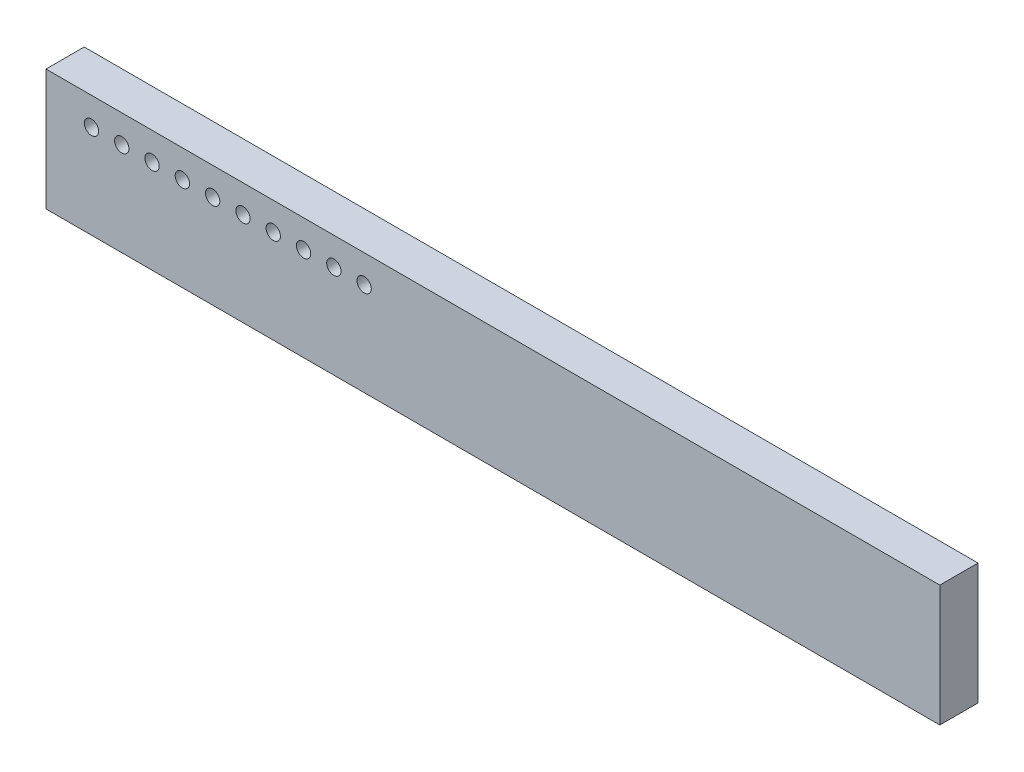
ISO-10303-21;
HEADER;
FILE_DESCRIPTION(('STEP AP214'),'2;1');
FILE_NAME('part.step','',(''),(''),'','','');
FILE_SCHEMA(('AUTOMOTIVE_DESIGN { 1 0 10303 214 1 1 1 1 }'));
ENDSEC;
DATA;
#1=APPLICATION_CONTEXT('core data for automotive mechanical design processes');
#2=APPLICATION_PROTOCOL_DEFINITION('international standard','automotive_design',2000,#1);
#3=PRODUCT_CONTEXT('',#1,'mechanical');
#4=PRODUCT('Part','Part','',(#3));
#5=PRODUCT_RELATED_PRODUCT_CATEGORY('part','',(#4));
#6=PRODUCT_DEFINITION_FORMATION('','',#4);
#7=PRODUCT_DEFINITION_CONTEXT('part definition',#1,'design');
#8=PRODUCT_DEFINITION('design','',#6,#7);
#9=PRODUCT_DEFINITION_SHAPE('','',#8);
#10=(LENGTH_UNIT() NAMED_UNIT(*) SI_UNIT(.MILLI.,.METRE.));
#11=(NAMED_UNIT(*) PLANE_ANGLE_UNIT() SI_UNIT($,.RADIAN.));
#12=(NAMED_UNIT(*) SI_UNIT($,.STERADIAN.) SOLID_ANGLE_UNIT());
#13=UNCERTAINTY_MEASURE_WITH_UNIT(LENGTH_MEASURE(1.E-05),#10,'distance_accuracy_value','');
#14=(GEOMETRIC_REPRESENTATION_CONTEXT(3) GLOBAL_UNCERTAINTY_ASSIGNED_CONTEXT((#13)) GLOBAL_UNIT_ASSIGNED_CONTEXT((#10,
#11,#12)) REPRESENTATION_CONTEXT('',''));
#15=CARTESIAN_POINT('',(0.,0.,0.));
#16=DIRECTION('',(0.,0.,1.));
#17=DIRECTION('',(1.,0.,0.));
#18=AXIS2_PLACEMENT_3D('',#15,#16,#17);
#19=CARTESIAN_POINT('',(18.7325,-2.54,1.6));
#20=DIRECTION('',(-1.,0.,0.));
#21=DIRECTION('',(0.,0.,1.));
#22=AXIS2_PLACEMENT_3D('',#19,#20,#21);
#23=PLANE('',#22);
#24=DIRECTION('',(0.,1.,0.));
#25=VECTOR('',#24,1.);
#26=CARTESIAN_POINT('',(18.7325,-2.54,0.));
#27=LINE('',#26,#25);
#28=CARTESIAN_POINT('',(18.7325,-2.54,0.));
#29=VERTEX_POINT('',#28);
#30=CARTESIAN_POINT('',(18.7325,2.54,0.));
#31=VERTEX_POINT('',#30);
#32=EDGE_CURVE('E99',#29,#31,#27,.T.);
#33=ORIENTED_EDGE('',*,*,#32,.T.);
#34=DIRECTION('',(0.,0.,-1.));
#35=VECTOR('',#34,1.);
#36=CARTESIAN_POINT('',(18.7325,2.54,1.6));
#37=LINE('',#36,#35);
#38=CARTESIAN_POINT('',(18.7325,2.54,1.6));
#39=VERTEX_POINT('',#38);
#40=EDGE_CURVE('E86',#39,#31,#37,.T.);
#41=ORIENTED_EDGE('',*,*,#40,.F.);
#42=DIRECTION('',(0.,1.,0.));
#43=VECTOR('',#42,1.);
#44=CARTESIAN_POINT('',(18.7325,-2.54,1.6));
#45=LINE('',#44,#43);
#46=CARTESIAN_POINT('',(18.7325,-2.54,1.6));
#47=VERTEX_POINT('',#46);
#48=EDGE_CURVE('E106',#47,#39,#45,.T.);
#49=ORIENTED_EDGE('',*,*,#48,.F.);
#50=DIRECTION('',(0.,0.,-1.));
#51=VECTOR('',#50,1.);
#52=CARTESIAN_POINT('',(18.7325,-2.54,1.6));
#53=LINE('',#52,#51);
#54=EDGE_CURVE('E88',#47,#29,#53,.T.);
#55=ORIENTED_EDGE('',*,*,#54,.T.);
#56=EDGE_LOOP('',(#33,#41,#49,#55));
#57=FACE_BOUND('',#56,.T.);
#58=ADVANCED_FACE('F32',(#57),#23,.F.);
#59=CARTESIAN_POINT('',(-18.7325,2.54,1.6));
#60=DIRECTION('',(0.,-1.,0.));
#61=DIRECTION('',(0.,0.,-1.));
#62=AXIS2_PLACEMENT_3D('',#59,#60,#61);
#63=PLANE('',#62);
#64=DIRECTION('',(-1.,0.,0.));
#65=VECTOR('',#64,1.);
#66=CARTESIAN_POINT('',(-18.7325,2.54,0.));
#67=LINE('',#66,#65);
#68=CARTESIAN_POINT('',(-18.7325,2.54,0.));
#69=VERTEX_POINT('',#68);
#70=EDGE_CURVE('E49',#31,#69,#67,.T.);
#71=ORIENTED_EDGE('',*,*,#70,.T.);
#72=DIRECTION('',(0.,0.,-1.));
#73=VECTOR('',#72,1.);
#74=CARTESIAN_POINT('',(-18.7325,2.54,1.6));
#75=LINE('',#74,#73);
#76=CARTESIAN_POINT('',(-18.7325,2.54,1.6));
#77=VERTEX_POINT('',#76);
#78=EDGE_CURVE('E83',#77,#69,#75,.T.);
#79=ORIENTED_EDGE('',*,*,#78,.F.);
#80=DIRECTION('',(-1.,0.,0.));
#81=VECTOR('',#80,1.);
#82=CARTESIAN_POINT('',(-18.7325,2.54,1.6));
#83=LINE('',#82,#81);
#84=EDGE_CURVE('E65',#39,#77,#83,.T.);
#85=ORIENTED_EDGE('',*,*,#84,.F.);
#86=ORIENTED_EDGE('',*,*,#40,.T.);
#87=EDGE_LOOP('',(#71,#79,#85,#86));
#88=FACE_BOUND('',#87,.T.);
#89=ADVANCED_FACE('F82',(#88),#63,.F.);
#90=CARTESIAN_POINT('',(-18.7325,-2.54,1.6));
#91=DIRECTION('',(1.,0.,0.));
#92=DIRECTION('',(0.,0.,-1.));
#93=AXIS2_PLACEMENT_3D('',#90,#91,#92);
#94=PLANE('',#93);
#95=DIRECTION('',(0.,-1.,0.));
#96=VECTOR('',#95,1.);
#97=CARTESIAN_POINT('',(-18.7325,-2.54,0.));
#98=LINE('',#97,#96);
#99=CARTESIAN_POINT('',(-18.7325,-2.54,0.));
#100=VERTEX_POINT('',#99);
#101=EDGE_CURVE('E80',#69,#100,#98,.T.);
#102=ORIENTED_EDGE('',*,*,#101,.T.);
#103=DIRECTION('',(0.,0.,-1.));
#104=VECTOR('',#103,1.);
#105=CARTESIAN_POINT('',(-18.7325,-2.54,1.6));
#106=LINE('',#105,#104);
#107=CARTESIAN_POINT('',(-18.7325,-2.54,1.6));
#108=VERTEX_POINT('',#107);
#109=EDGE_CURVE('E108',#108,#100,#106,.T.);
#110=ORIENTED_EDGE('',*,*,#109,.F.);
#111=DIRECTION('',(0.,-1.,0.));
#112=VECTOR('',#111,1.);
#113=CARTESIAN_POINT('',(-18.7325,-2.54,1.6));
#114=LINE('',#113,#112);
#115=EDGE_CURVE('E91',#77,#108,#114,.T.);
#116=ORIENTED_EDGE('',*,*,#115,.F.);
#117=ORIENTED_EDGE('',*,*,#78,.T.);
#118=EDGE_LOOP('',(#102,#110,#116,#117));
#119=FACE_BOUND('',#118,.T.);
#120=ADVANCED_FACE('F90',(#119),#94,.F.);
#121=CARTESIAN_POINT('',(-18.7325,-2.54,1.6));
#122=DIRECTION('',(0.,1.,0.));
#123=DIRECTION('',(0.,0.,1.));
#124=AXIS2_PLACEMENT_3D('',#121,#122,#123);
#125=PLANE('',#124);
#126=DIRECTION('',(1.,0.,0.));
#127=VECTOR('',#126,1.);
#128=CARTESIAN_POINT('',(-18.7325,-2.54,0.));
#129=LINE('',#128,#127);
#130=EDGE_CURVE('E74',#100,#29,#129,.T.);
#131=ORIENTED_EDGE('',*,*,#130,.T.);
#132=ORIENTED_EDGE('',*,*,#54,.F.);
#133=DIRECTION('',(1.,0.,0.));
#134=VECTOR('',#133,1.);
#135=CARTESIAN_POINT('',(-18.7325,-2.54,1.6));
#136=LINE('',#135,#134);
#137=EDGE_CURVE('E101',#108,#47,#136,.T.);
#138=ORIENTED_EDGE('',*,*,#137,.F.);
#139=ORIENTED_EDGE('',*,*,#109,.T.);
#140=EDGE_LOOP('',(#131,#132,#138,#139));
#141=FACE_BOUND('',#140,.T.);
#142=ADVANCED_FACE('F170',(#141),#125,.F.);
#143=CARTESIAN_POINT('',(0.,0.,1.6));
#144=DIRECTION('',(0.,0.,-1.));
#145=DIRECTION('',(-1.,0.,0.));
#146=AXIS2_PLACEMENT_3D('',#143,#144,#145);
#147=PLANE('',#146);
#148=CARTESIAN_POINT('',(-5.39750000000049,1.38000000000002,1.6));
#149=DIRECTION('',(0.,0.,1.));
#150=DIRECTION('',(1.,0.,0.));
#151=AXIS2_PLACEMENT_3D('',#148,#149,#150);
#152=CIRCLE('',#151,0.3);
#153=CARTESIAN_POINT('',(-5.09750000000049,1.38000000000002,1.6));
#154=VERTEX_POINT('',#153);
#155=EDGE_CURVE('E11',#154,#154,#152,.T.);
#156=ORIENTED_EDGE('',*,*,#155,.F.);
#157=EDGE_LOOP('',(#156));
#158=FACE_BOUND('',#157,.T.);
#159=CARTESIAN_POINT('',(-6.66750000000049,1.38000000000001,1.6));
#160=DIRECTION('',(0.,0.,1.));
#161=DIRECTION('',(1.,0.,0.));
#162=AXIS2_PLACEMENT_3D('',#159,#160,#161);
#163=CIRCLE('',#162,0.3);
#164=CARTESIAN_POINT('',(-6.36750000000049,1.38000000000001,1.6));
#165=VERTEX_POINT('',#164);
#166=EDGE_CURVE('E140',#165,#165,#163,.T.);
#167=ORIENTED_EDGE('',*,*,#166,.F.);
#168=EDGE_LOOP('',(#167));
#169=FACE_BOUND('',#168,.T.);
#170=CARTESIAN_POINT('',(-7.93750000000049,1.38,1.6));
#171=DIRECTION('',(0.,0.,1.));
#172=DIRECTION('',(1.,0.,0.));
#173=AXIS2_PLACEMENT_3D('',#170,#171,#172);
#174=CIRCLE('',#173,0.3);
#175=CARTESIAN_POINT('',(-7.63750000000049,1.38,1.6));
#176=VERTEX_POINT('',#175);
#177=EDGE_CURVE('E137',#176,#176,#174,.T.);
#178=ORIENTED_EDGE('',*,*,#177,.F.);
#179=EDGE_LOOP('',(#178));
#180=FACE_BOUND('',#179,.T.);
#181=CARTESIAN_POINT('',(-9.20750000000049,1.37999999999999,1.6));
#182=DIRECTION('',(0.,0.,1.));
#183=DIRECTION('',(1.,0.,0.));
#184=AXIS2_PLACEMENT_3D('',#181,#182,#183);
#185=CIRCLE('',#184,0.3);
#186=CARTESIAN_POINT('',(-8.90750000000049,1.37999999999999,1.6));
#187=VERTEX_POINT('',#186);
#188=EDGE_CURVE('E133',#187,#187,#185,.T.);
#189=ORIENTED_EDGE('',*,*,#188,.F.);
#190=EDGE_LOOP('',(#189));
#191=FACE_BOUND('',#190,.T.);
#192=CARTESIAN_POINT('',(-10.4775000000005,1.37999999999998,1.6));
#193=DIRECTION('',(0.,0.,1.));
#194=DIRECTION('',(1.,0.,0.));
#195=AXIS2_PLACEMENT_3D('',#192,#193,#194);
#196=CIRCLE('',#195,0.3);
#197=CARTESIAN_POINT('',(-10.1775000000005,1.37999999999998,1.6));
#198=VERTEX_POINT('',#197);
#199=EDGE_CURVE('E129',#198,#198,#196,.T.);
#200=ORIENTED_EDGE('',*,*,#199,.F.);
#201=EDGE_LOOP('',(#200));
#202=FACE_BOUND('',#201,.T.);
#203=CARTESIAN_POINT('',(-11.7475000000005,1.37999999999997,1.6));
#204=DIRECTION('',(0.,0.,1.));
#205=DIRECTION('',(1.,0.,0.));
#206=AXIS2_PLACEMENT_3D('',#203,#204,#205);
#207=CIRCLE('',#206,0.3);
#208=CARTESIAN_POINT('',(-11.4475000000005,1.37999999999997,1.6));
#209=VERTEX_POINT('',#208);
#210=EDGE_CURVE('E125',#209,#209,#207,.T.);
#211=ORIENTED_EDGE('',*,*,#210,.F.);
#212=EDGE_LOOP('',(#211));
#213=FACE_BOUND('',#212,.T.);
#214=CARTESIAN_POINT('',(-13.0175000000005,1.37999999999996,1.6));
#215=DIRECTION('',(0.,0.,1.));
#216=DIRECTION('',(1.,0.,0.));
#217=AXIS2_PLACEMENT_3D('',#214,#215,#216);
#218=CIRCLE('',#217,0.3);
#219=CARTESIAN_POINT('',(-12.7175000000005,1.37999999999996,1.6));
#220=VERTEX_POINT('',#219);
#221=EDGE_CURVE('E121',#220,#220,#218,.T.);
#222=ORIENTED_EDGE('',*,*,#221,.F.);
#223=EDGE_LOOP('',(#222));
#224=FACE_BOUND('',#223,.T.);
#225=CARTESIAN_POINT('',(-14.2875000000005,1.37999999999996,1.6));
#226=DIRECTION('',(0.,0.,1.));
#227=DIRECTION('',(1.,0.,0.));
#228=AXIS2_PLACEMENT_3D('',#225,#226,#227);
#229=CIRCLE('',#228,0.3);
#230=CARTESIAN_POINT('',(-13.9875000000005,1.37999999999996,1.6));
#231=VERTEX_POINT('',#230);
#232=EDGE_CURVE('E117',#231,#231,#229,.T.);
#233=ORIENTED_EDGE('',*,*,#232,.F.);
#234=EDGE_LOOP('',(#233));
#235=FACE_BOUND('',#234,.T.);
#236=CARTESIAN_POINT('',(-15.5575000000005,1.37999999999995,1.6));
#237=DIRECTION('',(0.,0.,1.));
#238=DIRECTION('',(1.,0.,0.));
#239=AXIS2_PLACEMENT_3D('',#236,#237,#238);
#240=CIRCLE('',#239,0.3);
#241=CARTESIAN_POINT('',(-15.2575000000005,1.37999999999995,1.6));
#242=VERTEX_POINT('',#241);
#243=EDGE_CURVE('E113',#242,#242,#240,.T.);
#244=ORIENTED_EDGE('',*,*,#243,.F.);
#245=EDGE_LOOP('',(#244));
#246=FACE_BOUND('',#245,.T.);
#247=CARTESIAN_POINT('',(-16.8275000000005,1.37999999999994,1.6));
#248=DIRECTION('',(0.,0.,1.));
#249=DIRECTION('',(1.,0.,0.));
#250=AXIS2_PLACEMENT_3D('',#247,#248,#249);
#251=CIRCLE('',#250,0.3);
#252=CARTESIAN_POINT('',(-16.5275000000005,1.37999999999994,1.6));
#253=VERTEX_POINT('',#252);
#254=EDGE_CURVE('E109',#253,#253,#251,.T.);
#255=ORIENTED_EDGE('',*,*,#254,.F.);
#256=EDGE_LOOP('',(#255));
#257=FACE_BOUND('',#256,.T.);
#258=ORIENTED_EDGE('',*,*,#48,.T.);
#259=ORIENTED_EDGE('',*,*,#84,.T.);
#260=ORIENTED_EDGE('',*,*,#115,.T.);
#261=ORIENTED_EDGE('',*,*,#137,.T.);
#262=EDGE_LOOP('',(#258,#259,#260,#261));
#263=FACE_BOUND('',#262,.T.);
#264=ADVANCED_FACE('F34',(#158,#169,#180,#191,#202,#213,#224,#235,#246,#257,#263),#147,.F.);
#265=CARTESIAN_POINT('',(0.,0.,0.));
#266=DIRECTION('',(0.,0.,-1.));
#267=DIRECTION('',(-1.,0.,0.));
#268=AXIS2_PLACEMENT_3D('',#265,#266,#267);
#269=PLANE('',#268);
#270=CARTESIAN_POINT('',(-5.39750000000049,1.38000000000002,0.));
#271=DIRECTION('',(0.,0.,-1.));
#272=DIRECTION('',(-1.,0.,0.));
#273=AXIS2_PLACEMENT_3D('',#270,#271,#272);
#274=CIRCLE('',#273,0.3);
#275=CARTESIAN_POINT('',(-5.69750000000049,1.38000000000002,0.));
#276=VERTEX_POINT('',#275);
#277=EDGE_CURVE('E41',#276,#276,#274,.T.);
#278=ORIENTED_EDGE('',*,*,#277,.F.);
#279=EDGE_LOOP('',(#278));
#280=FACE_BOUND('',#279,.T.);
#281=CARTESIAN_POINT('',(-6.66750000000049,1.38000000000001,0.));
#282=DIRECTION('',(0.,0.,-1.));
#283=DIRECTION('',(-1.,0.,0.));
#284=AXIS2_PLACEMENT_3D('',#281,#282,#283);
#285=CIRCLE('',#284,0.3);
#286=CARTESIAN_POINT('',(-6.96750000000049,1.38000000000001,0.));
#287=VERTEX_POINT('',#286);
#288=EDGE_CURVE('E139',#287,#287,#285,.T.);
#289=ORIENTED_EDGE('',*,*,#288,.F.);
#290=EDGE_LOOP('',(#289));
#291=FACE_BOUND('',#290,.T.);
#292=CARTESIAN_POINT('',(-7.93750000000049,1.38,0.));
#293=DIRECTION('',(0.,0.,-1.));
#294=DIRECTION('',(-1.,0.,0.));
#295=AXIS2_PLACEMENT_3D('',#292,#293,#294);
#296=CIRCLE('',#295,0.3);
#297=CARTESIAN_POINT('',(-8.23750000000049,1.38,0.));
#298=VERTEX_POINT('',#297);
#299=EDGE_CURVE('E136',#298,#298,#296,.T.);
#300=ORIENTED_EDGE('',*,*,#299,.F.);
#301=EDGE_LOOP('',(#300));
#302=FACE_BOUND('',#301,.T.);
#303=CARTESIAN_POINT('',(-9.20750000000049,1.37999999999999,0.));
#304=DIRECTION('',(0.,0.,-1.));
#305=DIRECTION('',(-1.,0.,0.));
#306=AXIS2_PLACEMENT_3D('',#303,#304,#305);
#307=CIRCLE('',#306,0.3);
#308=CARTESIAN_POINT('',(-9.50750000000049,1.37999999999999,0.));
#309=VERTEX_POINT('',#308);
#310=EDGE_CURVE('E132',#309,#309,#307,.T.);
#311=ORIENTED_EDGE('',*,*,#310,.F.);
#312=EDGE_LOOP('',(#311));
#313=FACE_BOUND('',#312,.T.);
#314=CARTESIAN_POINT('',(-10.4775000000005,1.37999999999998,0.));
#315=DIRECTION('',(0.,0.,-1.));
#316=DIRECTION('',(-1.,0.,0.));
#317=AXIS2_PLACEMENT_3D('',#314,#315,#316);
#318=CIRCLE('',#317,0.3);
#319=CARTESIAN_POINT('',(-10.7775000000005,1.37999999999998,0.));
#320=VERTEX_POINT('',#319);
#321=EDGE_CURVE('E128',#320,#320,#318,.T.);
#322=ORIENTED_EDGE('',*,*,#321,.F.);
#323=EDGE_LOOP('',(#322));
#324=FACE_BOUND('',#323,.T.);
#325=CARTESIAN_POINT('',(-11.7475000000005,1.37999999999997,0.));
#326=DIRECTION('',(0.,0.,-1.));
#327=DIRECTION('',(-1.,0.,0.));
#328=AXIS2_PLACEMENT_3D('',#325,#326,#327);
#329=CIRCLE('',#328,0.3);
#330=CARTESIAN_POINT('',(-12.0475000000005,1.37999999999997,0.));
#331=VERTEX_POINT('',#330);
#332=EDGE_CURVE('E124',#331,#331,#329,.T.);
#333=ORIENTED_EDGE('',*,*,#332,.F.);
#334=EDGE_LOOP('',(#333));
#335=FACE_BOUND('',#334,.T.);
#336=CARTESIAN_POINT('',(-13.0175000000005,1.37999999999996,0.));
#337=DIRECTION('',(0.,0.,-1.));
#338=DIRECTION('',(-1.,0.,0.));
#339=AXIS2_PLACEMENT_3D('',#336,#337,#338);
#340=CIRCLE('',#339,0.3);
#341=CARTESIAN_POINT('',(-13.3175000000005,1.37999999999996,0.));
#342=VERTEX_POINT('',#341);
#343=EDGE_CURVE('E120',#342,#342,#340,.T.);
#344=ORIENTED_EDGE('',*,*,#343,.F.);
#345=EDGE_LOOP('',(#344));
#346=FACE_BOUND('',#345,.T.);
#347=CARTESIAN_POINT('',(-14.2875000000005,1.37999999999996,0.));
#348=DIRECTION('',(0.,0.,-1.));
#349=DIRECTION('',(-1.,0.,0.));
#350=AXIS2_PLACEMENT_3D('',#347,#348,#349);
#351=CIRCLE('',#350,0.3);
#352=CARTESIAN_POINT('',(-14.5875000000005,1.37999999999996,0.));
#353=VERTEX_POINT('',#352);
#354=EDGE_CURVE('E116',#353,#353,#351,.T.);
#355=ORIENTED_EDGE('',*,*,#354,.F.);
#356=EDGE_LOOP('',(#355));
#357=FACE_BOUND('',#356,.T.);
#358=CARTESIAN_POINT('',(-15.5575000000005,1.37999999999995,0.));
#359=DIRECTION('',(0.,0.,-1.));
#360=DIRECTION('',(-1.,0.,0.));
#361=AXIS2_PLACEMENT_3D('',#358,#359,#360);
#362=CIRCLE('',#361,0.3);
#363=CARTESIAN_POINT('',(-15.8575000000005,1.37999999999995,0.));
#364=VERTEX_POINT('',#363);
#365=EDGE_CURVE('E112',#364,#364,#362,.T.);
#366=ORIENTED_EDGE('',*,*,#365,.F.);
#367=EDGE_LOOP('',(#366));
#368=FACE_BOUND('',#367,.T.);
#369=CARTESIAN_POINT('',(-16.8275000000005,1.37999999999994,0.));
#370=DIRECTION('',(0.,0.,-1.));
#371=DIRECTION('',(-1.,0.,0.));
#372=AXIS2_PLACEMENT_3D('',#369,#370,#371);
#373=CIRCLE('',#372,0.3);
#374=CARTESIAN_POINT('',(-17.1275000000005,1.37999999999994,0.));
#375=VERTEX_POINT('',#374);
#376=EDGE_CURVE('E103',#375,#375,#373,.T.);
#377=ORIENTED_EDGE('',*,*,#376,.F.);
#378=EDGE_LOOP('',(#377));
#379=FACE_BOUND('',#378,.T.);
#380=ORIENTED_EDGE('',*,*,#32,.F.);
#381=ORIENTED_EDGE('',*,*,#130,.F.);
#382=ORIENTED_EDGE('',*,*,#101,.F.);
#383=ORIENTED_EDGE('',*,*,#70,.F.);
#384=EDGE_LOOP('',(#380,#381,#382,#383));
#385=FACE_BOUND('',#384,.T.);
#386=ADVANCED_FACE('F93',(#280,#291,#302,#313,#324,#335,#346,#357,#368,#379,#385),#269,.T.);
#387=CARTESIAN_POINT('',(-16.8275000000005,1.37999999999994,-0.94));
#388=DIRECTION('',(0.,0.,1.));
#389=DIRECTION('',(1.,0.,0.));
#390=AXIS2_PLACEMENT_3D('',#387,#388,#389);
#391=CYLINDRICAL_SURFACE('',#390,0.3);
#392=ORIENTED_EDGE('',*,*,#376,.T.);
#393=EDGE_LOOP('',(#392));
#394=FACE_BOUND('',#393,.T.);
#395=ORIENTED_EDGE('',*,*,#254,.T.);
#396=EDGE_LOOP('',(#395));
#397=FACE_BOUND('',#396,.T.);
#398=ADVANCED_FACE('F177',(#394,#397),#391,.F.);
#399=CARTESIAN_POINT('',(-15.5575000000005,1.37999999999995,-0.94));
#400=DIRECTION('',(0.,0.,1.));
#401=DIRECTION('',(1.,0.,0.));
#402=AXIS2_PLACEMENT_3D('',#399,#400,#401);
#403=CYLINDRICAL_SURFACE('',#402,0.3);
#404=ORIENTED_EDGE('',*,*,#365,.T.);
#405=EDGE_LOOP('',(#404));
#406=FACE_BOUND('',#405,.T.);
#407=ORIENTED_EDGE('',*,*,#243,.T.);
#408=EDGE_LOOP('',(#407));
#409=FACE_BOUND('',#408,.T.);
#410=ADVANCED_FACE('F193',(#406,#409),#403,.F.);
#411=CARTESIAN_POINT('',(-14.2875000000005,1.37999999999996,-0.94));
#412=DIRECTION('',(0.,0.,1.));
#413=DIRECTION('',(1.,0.,0.));
#414=AXIS2_PLACEMENT_3D('',#411,#412,#413);
#415=CYLINDRICAL_SURFACE('',#414,0.3);
#416=ORIENTED_EDGE('',*,*,#354,.T.);
#417=EDGE_LOOP('',(#416));
#418=FACE_BOUND('',#417,.T.);
#419=ORIENTED_EDGE('',*,*,#232,.T.);
#420=EDGE_LOOP('',(#419));
#421=FACE_BOUND('',#420,.T.);
#422=ADVANCED_FACE('F197',(#418,#421),#415,.F.);
#423=CARTESIAN_POINT('',(-13.0175000000005,1.37999999999996,-0.94));
#424=DIRECTION('',(0.,0.,1.));
#425=DIRECTION('',(1.,0.,0.));
#426=AXIS2_PLACEMENT_3D('',#423,#424,#425);
#427=CYLINDRICAL_SURFACE('',#426,0.3);
#428=ORIENTED_EDGE('',*,*,#343,.T.);
#429=EDGE_LOOP('',(#428));
#430=FACE_BOUND('',#429,.T.);
#431=ORIENTED_EDGE('',*,*,#221,.T.);
#432=EDGE_LOOP('',(#431));
#433=FACE_BOUND('',#432,.T.);
#434=ADVANCED_FACE('F201',(#430,#433),#427,.F.);
#435=CARTESIAN_POINT('',(-11.7475000000005,1.37999999999997,-0.94));
#436=DIRECTION('',(0.,0.,1.));
#437=DIRECTION('',(1.,0.,0.));
#438=AXIS2_PLACEMENT_3D('',#435,#436,#437);
#439=CYLINDRICAL_SURFACE('',#438,0.3);
#440=ORIENTED_EDGE('',*,*,#332,.T.);
#441=EDGE_LOOP('',(#440));
#442=FACE_BOUND('',#441,.T.);
#443=ORIENTED_EDGE('',*,*,#210,.T.);
#444=EDGE_LOOP('',(#443));
#445=FACE_BOUND('',#444,.T.);
#446=ADVANCED_FACE('F205',(#442,#445),#439,.F.);
#447=CARTESIAN_POINT('',(-10.4775000000005,1.37999999999998,-0.94));
#448=DIRECTION('',(0.,0.,1.));
#449=DIRECTION('',(1.,0.,0.));
#450=AXIS2_PLACEMENT_3D('',#447,#448,#449);
#451=CYLINDRICAL_SURFACE('',#450,0.3);
#452=ORIENTED_EDGE('',*,*,#321,.T.);
#453=EDGE_LOOP('',(#452));
#454=FACE_BOUND('',#453,.T.);
#455=ORIENTED_EDGE('',*,*,#199,.T.);
#456=EDGE_LOOP('',(#455));
#457=FACE_BOUND('',#456,.T.);
#458=ADVANCED_FACE('F209',(#454,#457),#451,.F.);
#459=CARTESIAN_POINT('',(-9.20750000000049,1.37999999999999,-0.94));
#460=DIRECTION('',(0.,0.,1.));
#461=DIRECTION('',(1.,0.,0.));
#462=AXIS2_PLACEMENT_3D('',#459,#460,#461);
#463=CYLINDRICAL_SURFACE('',#462,0.3);
#464=ORIENTED_EDGE('',*,*,#310,.T.);
#465=EDGE_LOOP('',(#464));
#466=FACE_BOUND('',#465,.T.);
#467=ORIENTED_EDGE('',*,*,#188,.T.);
#468=EDGE_LOOP('',(#467));
#469=FACE_BOUND('',#468,.T.);
#470=ADVANCED_FACE('F213',(#466,#469),#463,.F.);
#471=CARTESIAN_POINT('',(-7.93750000000049,1.38,-0.94));
#472=DIRECTION('',(0.,0.,1.));
#473=DIRECTION('',(1.,0.,0.));
#474=AXIS2_PLACEMENT_3D('',#471,#472,#473);
#475=CYLINDRICAL_SURFACE('',#474,0.3);
#476=ORIENTED_EDGE('',*,*,#299,.T.);
#477=EDGE_LOOP('',(#476));
#478=FACE_BOUND('',#477,.T.);
#479=ORIENTED_EDGE('',*,*,#177,.T.);
#480=EDGE_LOOP('',(#479));
#481=FACE_BOUND('',#480,.T.);
#482=ADVANCED_FACE('F217',(#478,#481),#475,.F.);
#483=CARTESIAN_POINT('',(-6.66750000000049,1.38000000000001,-0.94));
#484=DIRECTION('',(0.,0.,1.));
#485=DIRECTION('',(1.,0.,0.));
#486=AXIS2_PLACEMENT_3D('',#483,#484,#485);
#487=CYLINDRICAL_SURFACE('',#486,0.3);
#488=ORIENTED_EDGE('',*,*,#288,.T.);
#489=EDGE_LOOP('',(#488));
#490=FACE_BOUND('',#489,.T.);
#491=ORIENTED_EDGE('',*,*,#166,.T.);
#492=EDGE_LOOP('',(#491));
#493=FACE_BOUND('',#492,.T.);
#494=ADVANCED_FACE('F221',(#490,#493),#487,.F.);
#495=CARTESIAN_POINT('',(-5.39750000000049,1.38000000000002,-0.94));
#496=DIRECTION('',(0.,0.,1.));
#497=DIRECTION('',(1.,0.,0.));
#498=AXIS2_PLACEMENT_3D('',#495,#496,#497);
#499=CYLINDRICAL_SURFACE('',#498,0.3);
#500=ORIENTED_EDGE('',*,*,#277,.T.);
#501=EDGE_LOOP('',(#500));
#502=FACE_BOUND('',#501,.T.);
#503=ORIENTED_EDGE('',*,*,#155,.T.);
#504=EDGE_LOOP('',(#503));
#505=FACE_BOUND('',#504,.T.);
#506=ADVANCED_FACE('F225',(#502,#505),#499,.F.);
#507=CLOSED_SHELL('',(#58,#89,#120,#142,#264,#386,#398,#410,#422,#434,#446,#458,#470,#482,#494,#506));
#508=MANIFOLD_SOLID_BREP('B2',#507);
#509=ADVANCED_BREP_SHAPE_REPRESENTATION('',(#18,#508),#14);
#510=SHAPE_DEFINITION_REPRESENTATION(#9,#509);
ENDSEC;
END-ISO-10303-21;
